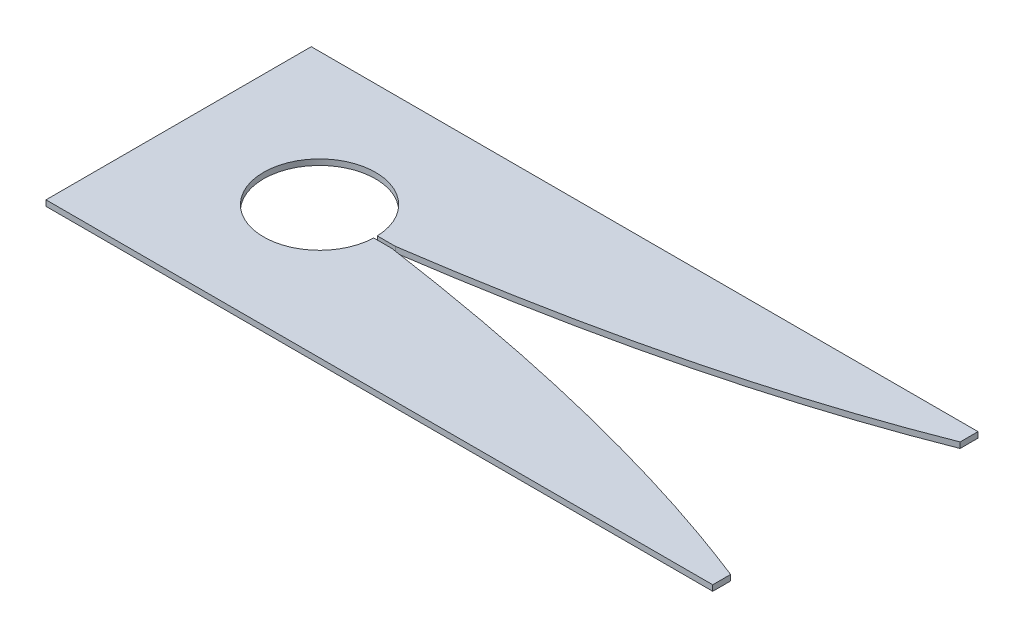
ISO-10303-21;
HEADER;
FILE_DESCRIPTION(('STEP AP214'),'2;1');
FILE_NAME('part.step','',(''),(''),'','','');
FILE_SCHEMA(('AUTOMOTIVE_DESIGN { 1 0 10303 214 1 1 1 1 }'));
ENDSEC;
DATA;
#1=APPLICATION_CONTEXT('core data for automotive mechanical design processes');
#2=APPLICATION_PROTOCOL_DEFINITION('international standard','automotive_design',2000,#1);
#3=PRODUCT_CONTEXT('',#1,'mechanical');
#4=PRODUCT('Part','Part','',(#3));
#5=PRODUCT_RELATED_PRODUCT_CATEGORY('part','',(#4));
#6=PRODUCT_DEFINITION_FORMATION('','',#4);
#7=PRODUCT_DEFINITION_CONTEXT('part definition',#1,'design');
#8=PRODUCT_DEFINITION('design','',#6,#7);
#9=PRODUCT_DEFINITION_SHAPE('','',#8);
#10=(LENGTH_UNIT() NAMED_UNIT(*) SI_UNIT(.MILLI.,.METRE.));
#11=(NAMED_UNIT(*) PLANE_ANGLE_UNIT() SI_UNIT($,.RADIAN.));
#12=(NAMED_UNIT(*) SI_UNIT($,.STERADIAN.) SOLID_ANGLE_UNIT());
#13=UNCERTAINTY_MEASURE_WITH_UNIT(LENGTH_MEASURE(1.E-05),#10,'distance_accuracy_value','');
#14=(GEOMETRIC_REPRESENTATION_CONTEXT(3) GLOBAL_UNCERTAINTY_ASSIGNED_CONTEXT((#13)) GLOBAL_UNIT_ASSIGNED_CONTEXT((#10,
#11,#12)) REPRESENTATION_CONTEXT('',''));
#15=CARTESIAN_POINT('',(0.,0.,0.));
#16=DIRECTION('',(0.,0.,1.));
#17=DIRECTION('',(1.,0.,0.));
#18=AXIS2_PLACEMENT_3D('',#15,#16,#17);
#19=CARTESIAN_POINT('',(92.999941,1.5875,37.000053));
#20=DIRECTION('',(-1.,0.,0.));
#21=DIRECTION('',(0.,0.,1.));
#22=AXIS2_PLACEMENT_3D('',#19,#20,#21);
#23=PLANE('',#22);
#24=DIRECTION('',(0.,0.,-1.));
#25=VECTOR('',#24,1.);
#26=CARTESIAN_POINT('',(92.999941,1.5875,37.000053));
#27=LINE('',#26,#25);
#28=CARTESIAN_POINT('',(92.999941,1.5875,-31.9999356329172));
#29=VERTEX_POINT('',#28);
#30=CARTESIAN_POINT('',(92.999941,1.5875,-37.000053));
#31=VERTEX_POINT('',#30);
#32=EDGE_CURVE('E209',#29,#31,#27,.T.);
#33=ORIENTED_EDGE('',*,*,#32,.F.);
#34=DIRECTION('',(0.,-1.,0.));
#35=VECTOR('',#34,1.);
#36=CARTESIAN_POINT('',(92.999941,1.5875,-31.9999356329173));
#37=LINE('',#36,#35);
#38=CARTESIAN_POINT('',(92.999941,0.,-31.9999356329172));
#39=VERTEX_POINT('',#38);
#40=EDGE_CURVE('E200',#29,#39,#37,.T.);
#41=ORIENTED_EDGE('',*,*,#40,.T.);
#42=DIRECTION('',(0.,0.,-1.));
#43=VECTOR('',#42,1.);
#44=CARTESIAN_POINT('',(92.999941,0.,37.000053));
#45=LINE('',#44,#43);
#46=CARTESIAN_POINT('',(92.999941,0.,-37.000053));
#47=VERTEX_POINT('',#46);
#48=EDGE_CURVE('E220',#39,#47,#45,.T.);
#49=ORIENTED_EDGE('',*,*,#48,.T.);
#50=DIRECTION('',(0.,-1.,0.));
#51=VECTOR('',#50,1.);
#52=CARTESIAN_POINT('',(92.999941,1.5875,-37.000053));
#53=LINE('',#52,#51);
#54=EDGE_CURVE('E229',#31,#47,#53,.T.);
#55=ORIENTED_EDGE('',*,*,#54,.F.);
#56=EDGE_LOOP('',(#33,#41,#49,#55));
#57=FACE_BOUND('',#56,.T.);
#58=ADVANCED_FACE('F50',(#57),#23,.F.);
#59=CARTESIAN_POINT('',(-92.999941,1.5875,37.000053));
#60=DIRECTION('',(-1.,0.,0.));
#61=DIRECTION('',(0.,0.,1.));
#62=AXIS2_PLACEMENT_3D('',#59,#60,#61);
#63=PLANE('',#62);
#64=DIRECTION('',(0.,0.,-1.));
#65=VECTOR('',#64,1.);
#66=CARTESIAN_POINT('',(-92.999941,0.,37.000053));
#67=LINE('',#66,#65);
#68=CARTESIAN_POINT('',(-92.999941,0.,37.000053));
#69=VERTEX_POINT('',#68);
#70=CARTESIAN_POINT('',(-92.999941,0.,-37.000053));
#71=VERTEX_POINT('',#70);
#72=EDGE_CURVE('E203',#69,#71,#67,.T.);
#73=ORIENTED_EDGE('',*,*,#72,.F.);
#74=DIRECTION('',(0.,-1.,0.));
#75=VECTOR('',#74,1.);
#76=CARTESIAN_POINT('',(-92.999941,1.5875,37.000053));
#77=LINE('',#76,#75);
#78=CARTESIAN_POINT('',(-92.999941,1.5875,37.000053));
#79=VERTEX_POINT('',#78);
#80=EDGE_CURVE('E74',#79,#69,#77,.T.);
#81=ORIENTED_EDGE('',*,*,#80,.F.);
#82=DIRECTION('',(0.,0.,-1.));
#83=VECTOR('',#82,1.);
#84=CARTESIAN_POINT('',(-92.999941,1.5875,37.000053));
#85=LINE('',#84,#83);
#86=CARTESIAN_POINT('',(-92.999941,1.5875,-37.000053));
#87=VERTEX_POINT('',#86);
#88=EDGE_CURVE('E204',#79,#87,#85,.T.);
#89=ORIENTED_EDGE('',*,*,#88,.T.);
#90=DIRECTION('',(0.,-1.,0.));
#91=VECTOR('',#90,1.);
#92=CARTESIAN_POINT('',(-92.999941,1.5875,-37.000053));
#93=LINE('',#92,#91);
#94=EDGE_CURVE('E99',#87,#71,#93,.T.);
#95=ORIENTED_EDGE('',*,*,#94,.T.);
#96=EDGE_LOOP('',(#73,#81,#89,#95));
#97=FACE_BOUND('',#96,.T.);
#98=ADVANCED_FACE('F52',(#97),#63,.T.);
#99=CARTESIAN_POINT('',(-92.999941,1.5875,37.000053));
#100=DIRECTION('',(0.,0.,-1.));
#101=DIRECTION('',(-1.,0.,0.));
#102=AXIS2_PLACEMENT_3D('',#99,#100,#101);
#103=PLANE('',#102);
#104=DIRECTION('',(1.,0.,0.));
#105=VECTOR('',#104,1.);
#106=CARTESIAN_POINT('',(-92.999941,0.,37.000053));
#107=LINE('',#106,#105);
#108=CARTESIAN_POINT('',(92.999941,0.,37.000053));
#109=VERTEX_POINT('',#108);
#110=EDGE_CURVE('E207',#69,#109,#107,.T.);
#111=ORIENTED_EDGE('',*,*,#110,.T.);
#112=DIRECTION('',(0.,-1.,0.));
#113=VECTOR('',#112,1.);
#114=CARTESIAN_POINT('',(92.999941,1.5875,37.000053));
#115=LINE('',#114,#113);
#116=CARTESIAN_POINT('',(92.999941,1.5875,37.000053));
#117=VERTEX_POINT('',#116);
#118=EDGE_CURVE('E226',#117,#109,#115,.T.);
#119=ORIENTED_EDGE('',*,*,#118,.F.);
#120=DIRECTION('',(1.,0.,0.));
#121=VECTOR('',#120,1.);
#122=CARTESIAN_POINT('',(-92.999941,1.5875,37.000053));
#123=LINE('',#122,#121);
#124=EDGE_CURVE('E213',#79,#117,#123,.T.);
#125=ORIENTED_EDGE('',*,*,#124,.F.);
#126=ORIENTED_EDGE('',*,*,#80,.T.);
#127=EDGE_LOOP('',(#111,#119,#125,#126));
#128=FACE_BOUND('',#127,.T.);
#129=ADVANCED_FACE('F265',(#128),#103,.F.);
#130=CARTESIAN_POINT('',(92.999941,0.,31.9999356326082));
#131=VERTEX_POINT('',#130);
#132=EDGE_CURVE('E221',#109,#131,#45,.T.);
#133=ORIENTED_EDGE('',*,*,#132,.T.);
#134=DIRECTION('',(0.,1.,0.));
#135=VECTOR('',#134,1.);
#136=CARTESIAN_POINT('',(92.999941,1.5875,31.9999356326082));
#137=LINE('',#136,#135);
#138=CARTESIAN_POINT('',(92.999941,1.5875,31.9999356326082));
#139=VERTEX_POINT('',#138);
#140=EDGE_CURVE('E190',#131,#139,#137,.T.);
#141=ORIENTED_EDGE('',*,*,#140,.T.);
#142=EDGE_CURVE('E210',#117,#139,#27,.T.);
#143=ORIENTED_EDGE('',*,*,#142,.F.);
#144=ORIENTED_EDGE('',*,*,#118,.T.);
#145=EDGE_LOOP('',(#133,#141,#143,#144));
#146=FACE_BOUND('',#145,.T.);
#147=ADVANCED_FACE('F268',(#146),#23,.F.);
#148=CARTESIAN_POINT('',(-92.999941,1.5875,-37.000053));
#149=DIRECTION('',(0.,0.,-1.));
#150=DIRECTION('',(-1.,0.,0.));
#151=AXIS2_PLACEMENT_3D('',#148,#149,#150);
#152=PLANE('',#151);
#153=DIRECTION('',(1.,0.,0.));
#154=VECTOR('',#153,1.);
#155=CARTESIAN_POINT('',(-92.999941,0.,-37.000053));
#156=LINE('',#155,#154);
#157=EDGE_CURVE('E217',#71,#47,#156,.T.);
#158=ORIENTED_EDGE('',*,*,#157,.F.);
#159=ORIENTED_EDGE('',*,*,#94,.F.);
#160=DIRECTION('',(1.,0.,0.));
#161=VECTOR('',#160,1.);
#162=CARTESIAN_POINT('',(-92.999941,1.5875,-37.000053));
#163=LINE('',#162,#161);
#164=EDGE_CURVE('E206',#87,#31,#163,.T.);
#165=ORIENTED_EDGE('',*,*,#164,.T.);
#166=ORIENTED_EDGE('',*,*,#54,.T.);
#167=EDGE_LOOP('',(#158,#159,#165,#166));
#168=FACE_BOUND('',#167,.T.);
#169=ADVANCED_FACE('F260',(#168),#152,.T.);
#170=CARTESIAN_POINT('',(0.,1.5875,0.));
#171=DIRECTION('',(0.,-1.,0.));
#172=DIRECTION('',(0.,0.,-1.));
#173=AXIS2_PLACEMENT_3D('',#170,#171,#172);
#174=PLANE('',#173);
#175=CARTESIAN_POINT('',(92.9639999983848,1.5875,-31.9999356317202));
#176=CARTESIAN_POINT('',(92.7413234028341,1.5875,-31.9121516083799));
#177=CARTESIAN_POINT('',(92.2824844520802,1.5875,-31.7318555070721));
#178=CARTESIAN_POINT('',(91.2914238419887,1.5875,-31.3438006264306));
#179=CARTESIAN_POINT('',(90.3222034107655,1.5875,-30.9687399669261));
#180=CARTESIAN_POINT('',(88.9415512880946,1.5875,-30.4375974416566));
#181=CARTESIAN_POINT('',(87.3598432451995,1.5875,-29.836757063068));
#182=CARTESIAN_POINT('',(85.465097241272,1.5875,-29.1263276716148));
#183=CARTESIAN_POINT('',(83.3244314075179,1.5875,-28.3377815935674));
#184=CARTESIAN_POINT('',(81.4320495838699,1.5875,-27.6519768728103));
#185=CARTESIAN_POINT('',(79.8161903880767,1.5875,-27.0749027747831));
#186=CARTESIAN_POINT('',(78.1933942776226,1.5875,-26.5016943116937));
#187=CARTESIAN_POINT('',(76.0299443100916,1.5875,-25.7462755789429));
#188=CARTESIAN_POINT('',(73.5890954699831,1.5875,-24.9107586062028));
#189=CARTESIAN_POINT('',(70.8719210598207,1.5875,-24.0016871127042));
#190=CARTESIAN_POINT('',(68.1479654932993,1.5875,-23.110854225357));
#191=CARTESIAN_POINT('',(65.9655382039849,1.5875,-22.4092924925014));
#192=CARTESIAN_POINT('',(63.2329669974784,1.5875,-21.5458464178883));
#193=CARTESIAN_POINT('',(59.947265612644,1.5875,-20.5312588090888));
#194=CARTESIAN_POINT('',(56.1044570234878,1.5875,-19.3783785535396));
#195=CARTESIAN_POINT('',(51.7005537982003,1.5875,-18.1021392954443));
#196=CARTESIAN_POINT('',(47.2851165058326,1.5875,-16.8662290967562));
#197=CARTESIAN_POINT('',(42.8589035122644,1.5875,-15.6696882108352));
#198=CARTESIAN_POINT('',(37.9946086231032,1.5875,-14.3998211420612));
#199=CARTESIAN_POINT('',(33.1185517182221,1.5875,-13.1762342868841));
#200=CARTESIAN_POINT('',(28.2313005909117,1.5875,-11.9974336786707));
#201=CARTESIAN_POINT('',(22.2174651876076,1.5875,-10.603163226866));
#202=CARTESIAN_POINT('',(16.6208780347632,1.5875,-9.36547980815923));
#203=CARTESIAN_POINT('',(11.0134666203684,1.5875,-8.18233985098925));
#204=CARTESIAN_POINT('',(4.27022991040086,1.5875,-6.82483511989842));
#205=CARTESIAN_POINT('',(-1.35674668244988,1.5875,-5.74447068063833));
#206=CARTESIAN_POINT('',(-6.43351670914174,1.5875,-4.81495732448502));
#207=CARTESIAN_POINT('',(-10.9454423896842,1.5875,-4.02194290100546));
#208=CARTESIAN_POINT('',(-13.7765103002821,1.5875,-3.53622728640687));
#209=CARTESIAN_POINT('',(-16.022726378814,1.5875,-3.15719422874165));
#210=CARTESIAN_POINT('',(-18.3124057889908,1.5875,-2.77851200286254));
#211=CARTESIAN_POINT('',(-20.5263723426658,1.5875,-2.41749450656961));
#212=CARTESIAN_POINT('',(-22.8723979476973,1.5875,-2.04366009860453));
#213=CARTESIAN_POINT('',(-25.0001316371141,1.5875,-1.70812103921486));
#214=CARTESIAN_POINT('',(-27.4950633291685,1.5875,-1.32517938237059));
#215=CARTESIAN_POINT('',(-29.3709839803506,1.5875,-1.03890684241712));
#216=CARTESIAN_POINT('',(-31.5860357326577,1.5875,-0.710618844173279));
#217=CARTESIAN_POINT('',(-32.5463249910256,1.5875,-0.56924593392239));
#218=CARTESIAN_POINT('',(-33.0200000016517,1.5875,-0.499998887179399));
#219=B_SPLINE_CURVE_WITH_KNOTS('',4,(#175,#176,#177,#178,#179,#180,#181,#182,#183,#184,#185,
#186,#187,#188,#189,#190,#191,#192,#193,#194,#195,#196,#197,#198,#199,#200,#201,#202,#203,#204,
#205,#206,#207,#208,#209,#210,#211,#212,#213,#214,#215,#216,#217,#218),.UNSPECIFIED.,.F.,.F.,(5,
1,1,1,1,1,1,1,1,1,1,1,1,1,1,1,1,1,1,1,1,1,1,1,1,1,1,1,1,1,1,1,1,1,1,1,1,1,1,1,5),
(0.0816312789331893,0.0889875474594602,0.0963438159606334,0.103700084461807,0.11105635296298,
0.125768870568056,0.140481388173131,0.15519390726077,0.169906426348408,0.177262690746391,
0.184618955144375,0.199331483940341,0.228756516656862,0.243469044505909,0.258181572354955,
0.272894098164366,0.287606623973778,0.317031659337775,0.346456716660709,0.375881753364466,
0.405306804206277,0.43473185418677,0.464156891521262,0.504932281131886,0.53435732760056,
0.563782374069234,0.622632465759951,0.652057512476629,0.681482559193308,0.740332650558701,
0.769757697383078,0.784470220795266,0.799182744207455,0.81389526755352,0.828607790899584,
0.843320314245649,0.858032837591714,0.872745360641079,0.887457883690444,0.90217040673981,
0.916882929761849),.UNSPECIFIED.);
#220=CARTESIAN_POINT('',(92.9640000014214,1.5875,-31.9999356329172));
#221=VERTEX_POINT('',#220);
#222=CARTESIAN_POINT('',(-33.0199999984335,1.5875,-0.499998887649878));
#223=VERTEX_POINT('',#222);
#224=EDGE_CURVE('E157',#221,#223,#219,.T.);
#225=ORIENTED_EDGE('',*,*,#224,.F.);
#226=DIRECTION('',(-1.,0.,0.));
#227=VECTOR('',#226,1.);
#228=CARTESIAN_POINT('',(92.9640000014214,1.5875,-31.9999356329172));
#229=LINE('',#228,#227);
#230=EDGE_CURVE('E154',#29,#221,#229,.T.);
#231=ORIENTED_EDGE('',*,*,#230,.F.);
#232=ORIENTED_EDGE('',*,*,#32,.T.);
#233=ORIENTED_EDGE('',*,*,#164,.F.);
#234=ORIENTED_EDGE('',*,*,#88,.F.);
#235=ORIENTED_EDGE('',*,*,#124,.T.);
#236=ORIENTED_EDGE('',*,*,#142,.T.);
#237=DIRECTION('',(1.,0.,0.));
#238=VECTOR('',#237,1.);
#239=CARTESIAN_POINT('',(94.1907730477055,1.5875,31.9999356326082));
#240=LINE('',#239,#238);
#241=CARTESIAN_POINT('',(92.963999999889,1.5875,31.9999356315199));
#242=VERTEX_POINT('',#241);
#243=EDGE_CURVE('E183',#242,#139,#240,.T.);
#244=ORIENTED_EDGE('',*,*,#243,.F.);
#245=CARTESIAN_POINT('',(-33.0200000002696,1.5875,0.499998887466894));
#246=CARTESIAN_POINT('',(-32.5463249896432,1.5875,0.569245934208052));
#247=CARTESIAN_POINT('',(-31.5860357312747,1.5875,0.710618844455222));
#248=CARTESIAN_POINT('',(-29.3709839789664,1.5875,1.03890684269049));
#249=CARTESIAN_POINT('',(-27.4950633277831,1.5875,1.3251793826367));
#250=CARTESIAN_POINT('',(-25.0001316357273,1.5875,1.70812103947131));
#251=CARTESIAN_POINT('',(-22.8723979463092,1.5875,2.04366009885274));
#252=CARTESIAN_POINT('',(-20.5263723412762,1.5875,2.41749450680874));
#253=CARTESIAN_POINT('',(-18.3124057875998,1.5875,2.7785120030931));
#254=CARTESIAN_POINT('',(-16.0227263774216,1.5875,3.15719422896334));
#255=CARTESIAN_POINT('',(-13.7765102988881,1.5875,3.53622728661986));
#256=CARTESIAN_POINT('',(-10.9454423882884,1.5875,4.0219429012075));
#257=CARTESIAN_POINT('',(-6.43351670774287,1.5875,4.81495732466959));
#258=CARTESIAN_POINT('',(-1.35674668104741,1.5875,5.74447068080324));
#259=CARTESIAN_POINT('',(4.27022991180751,1.5875,6.82483512004154));
#260=CARTESIAN_POINT('',(11.0134666217803,1.5875,8.18233985110627));
#261=CARTESIAN_POINT('',(16.6208780361797,1.5875,9.36547980825453));
#262=CARTESIAN_POINT('',(22.2174651890289,1.5875,10.6031632269396));
#263=CARTESIAN_POINT('',(28.2313005923384,1.5875,11.9974336787211));
#264=CARTESIAN_POINT('',(33.1185517196534,1.5875,13.1762342869155));
#265=CARTESIAN_POINT('',(37.9946086245392,1.5875,14.3998211420737));
#266=CARTESIAN_POINT('',(42.8589035137053,1.5875,15.6696882108289));
#267=CARTESIAN_POINT('',(47.2851165072782,1.5875,16.8662290967328));
#268=CARTESIAN_POINT('',(51.7005537996507,1.5875,18.1021392954038));
#269=CARTESIAN_POINT('',(56.1044570249431,1.5875,19.378378553482));
#270=CARTESIAN_POINT('',(59.9472656141037,1.5875,20.5312588090163));
#271=CARTESIAN_POINT('',(63.2329669989421,1.5875,21.5458464178032));
#272=CARTESIAN_POINT('',(65.9655382054519,1.5875,22.4092924924057));
#273=CARTESIAN_POINT('',(68.147965494769,1.5875,23.1108542252529));
#274=CARTESIAN_POINT('',(70.8719210612939,1.5875,24.0016871125895));
#275=CARTESIAN_POINT('',(73.5890954714597,1.5875,24.9107586060776));
#276=CARTESIAN_POINT('',(76.0299443115715,1.5875,25.7462755788082));
#277=CARTESIAN_POINT('',(78.1933942791055,1.5875,26.5016943115506));
#278=CARTESIAN_POINT('',(79.8161903895617,1.5875,27.0749027746337));
#279=CARTESIAN_POINT('',(81.4320495853572,1.5875,27.6519768726547));
#280=CARTESIAN_POINT('',(83.3244314090079,1.5875,28.3377815934045));
#281=CARTESIAN_POINT('',(85.465097242765,1.5875,29.1263276714435));
#282=CARTESIAN_POINT('',(87.3598432466952,1.5875,29.8367570628894));
#283=CARTESIAN_POINT('',(88.9415512895927,1.5875,30.4375974414719));
#284=CARTESIAN_POINT('',(90.3222034122656,1.5875,30.968739966736));
#285=CARTESIAN_POINT('',(91.2914238434903,1.5875,31.3438006262368));
#286=CARTESIAN_POINT('',(92.2824844535833,1.5875,31.7318555068744));
#287=CARTESIAN_POINT('',(92.7413234043379,1.5875,31.9121516081805));
#288=CARTESIAN_POINT('',(92.963999999889,1.5875,31.9999356315199));
#289=B_SPLINE_CURVE_WITH_KNOTS('',4,(#245,#246,#247,#248,#249,#250,#251,#252,#253,#254,#255,
#256,#257,#258,#259,#260,#261,#262,#263,#264,#265,#266,#267,#268,#269,#270,#271,#272,#273,#274,
#275,#276,#277,#278,#279,#280,#281,#282,#283,#284,#285,#286,#287,#288),.UNSPECIFIED.,.F.,.F.,(5,
1,1,1,1,1,1,1,1,1,1,1,1,1,1,1,1,1,1,1,1,1,1,1,1,1,1,1,1,1,1,1,1,1,1,1,1,1,1,1,5),
(0.0816312789309171,0.0963438019552293,0.111056325004594,0.12576884805396,0.140481371103325,
0.15519389444939,0.169906417795454,0.184618941141519,0.199331464487584,0.214043987899772,
0.228756511311961,0.258181558136338,0.317031649501731,0.346456696218409,0.375881742935087,
0.434731834625805,0.464156881094478,0.493581927563152,0.534357317173776,0.563782354508268,
0.593207404488761,0.622632455330572,0.65205749203433,0.681482549357263,0.710907584721261,
0.725620110530672,0.740332636340084,0.75504516418913,0.769757692038177,0.799182724754697,
0.813895253550664,0.821251517948647,0.828607782346631,0.843320301434269,0.858032820521907,
0.872745338126983,0.887457855732059,0.894814124233232,0.902170392734405,0.909526661235579,
0.916882929759568),.UNSPECIFIED.);
#290=CARTESIAN_POINT('',(-33.0199999973439,1.5875,0.499998887894597));
#291=VERTEX_POINT('',#290);
#292=EDGE_CURVE('E178',#291,#242,#289,.T.);
#293=ORIENTED_EDGE('',*,*,#292,.F.);
#294=DIRECTION('',(1.,0.,0.));
#295=VECTOR('',#294,1.);
#296=CARTESIAN_POINT('',(-38.0763464790078,1.5875,0.499998887894597));
#297=LINE('',#296,#295);
#298=CARTESIAN_POINT('',(-38.0763464790078,1.5875,0.499998887894597));
#299=VERTEX_POINT('',#298);
#300=EDGE_CURVE('E170',#299,#291,#297,.T.);
#301=ORIENTED_EDGE('',*,*,#300,.F.);
#302=CARTESIAN_POINT('',(-53.6893424168291,1.5875,4.23199016448941E-08));
#303=DIRECTION('',(0.,1.,0.));
#304=DIRECTION('',(0.,0.,1.));
#305=AXIS2_PLACEMENT_3D('',#302,#303,#304);
#306=CIRCLE('',#305,15.621);
#307=CARTESIAN_POINT('',(-38.0763464817105,1.5875,-0.499998887649877));
#308=VERTEX_POINT('',#307);
#309=EDGE_CURVE('E168',#308,#299,#306,.T.);
#310=ORIENTED_EDGE('',*,*,#309,.F.);
#311=DIRECTION('',(-1.,0.,0.));
#312=VECTOR('',#311,1.);
#313=CARTESIAN_POINT('',(-33.0199999984335,1.5875,-0.499998887649878));
#314=LINE('',#313,#312);
#315=EDGE_CURVE('E148',#223,#308,#314,.T.);
#316=ORIENTED_EDGE('',*,*,#315,.F.);
#317=EDGE_LOOP('',(#225,#231,#232,#233,#234,#235,#236,#244,#293,#301,#310,#316));
#318=FACE_BOUND('',#317,.T.);
#319=ADVANCED_FACE('F165',(#318),#174,.F.);
#320=CARTESIAN_POINT('',(0.,0.,0.));
#321=DIRECTION('',(0.,-1.,0.));
#322=DIRECTION('',(0.,0.,-1.));
#323=AXIS2_PLACEMENT_3D('',#320,#321,#322);
#324=PLANE('',#323);
#325=DIRECTION('',(1.,0.,0.));
#326=VECTOR('',#325,1.);
#327=CARTESIAN_POINT('',(0.,0.,-31.9999356329172));
#328=LINE('',#327,#326);
#329=CARTESIAN_POINT('',(92.9640000014214,0.,-31.9999356329172));
#330=VERTEX_POINT('',#329);
#331=EDGE_CURVE('E13',#330,#39,#328,.T.);
#332=ORIENTED_EDGE('',*,*,#331,.F.);
#333=CARTESIAN_POINT('',(92.9639999983848,0.,-31.9999356317202));
#334=CARTESIAN_POINT('',(92.7413234028341,0.,-31.9121516083799));
#335=CARTESIAN_POINT('',(92.2824844520802,0.,-31.7318555070721));
#336=CARTESIAN_POINT('',(91.2914238419887,0.,-31.3438006264306));
#337=CARTESIAN_POINT('',(90.3222034107655,0.,-30.9687399669261));
#338=CARTESIAN_POINT('',(88.9415512880946,0.,-30.4375974416566));
#339=CARTESIAN_POINT('',(87.3598432451995,0.,-29.836757063068));
#340=CARTESIAN_POINT('',(85.465097241272,0.,-29.1263276716148));
#341=CARTESIAN_POINT('',(83.3244314075179,0.,-28.3377815935674));
#342=CARTESIAN_POINT('',(81.4320495838699,0.,-27.6519768728103));
#343=CARTESIAN_POINT('',(79.8161903880767,0.,-27.0749027747831));
#344=CARTESIAN_POINT('',(78.1933942776226,0.,-26.5016943116937));
#345=CARTESIAN_POINT('',(76.0299443100916,0.,-25.7462755789429));
#346=CARTESIAN_POINT('',(73.5890954699831,0.,-24.9107586062028));
#347=CARTESIAN_POINT('',(70.8719210598207,0.,-24.0016871127042));
#348=CARTESIAN_POINT('',(68.1479654932993,0.,-23.110854225357));
#349=CARTESIAN_POINT('',(65.9655382039849,0.,-22.4092924925014));
#350=CARTESIAN_POINT('',(63.2329669974784,0.,-21.5458464178883));
#351=CARTESIAN_POINT('',(59.947265612644,0.,-20.5312588090888));
#352=CARTESIAN_POINT('',(56.1044570234878,0.,-19.3783785535396));
#353=CARTESIAN_POINT('',(51.7005537982003,0.,-18.1021392954443));
#354=CARTESIAN_POINT('',(47.2851165058326,0.,-16.8662290967562));
#355=CARTESIAN_POINT('',(42.8589035122644,0.,-15.6696882108352));
#356=CARTESIAN_POINT('',(37.9946086231032,0.,-14.3998211420612));
#357=CARTESIAN_POINT('',(33.1185517182221,0.,-13.1762342868841));
#358=CARTESIAN_POINT('',(28.2313005909117,0.,-11.9974336786707));
#359=CARTESIAN_POINT('',(22.2174651876076,0.,-10.603163226866));
#360=CARTESIAN_POINT('',(16.6208780347632,0.,-9.36547980815923));
#361=CARTESIAN_POINT('',(11.0134666203684,0.,-8.18233985098925));
#362=CARTESIAN_POINT('',(4.27022991040086,0.,-6.82483511989842));
#363=CARTESIAN_POINT('',(-1.35674668244988,0.,-5.74447068063833));
#364=CARTESIAN_POINT('',(-6.43351670914174,0.,-4.81495732448502));
#365=CARTESIAN_POINT('',(-10.9454423896842,0.,-4.02194290100546));
#366=CARTESIAN_POINT('',(-13.7765103002821,0.,-3.53622728640687));
#367=CARTESIAN_POINT('',(-16.022726378814,0.,-3.15719422874165));
#368=CARTESIAN_POINT('',(-18.3124057889908,0.,-2.77851200286254));
#369=CARTESIAN_POINT('',(-20.5263723426658,0.,-2.41749450656961));
#370=CARTESIAN_POINT('',(-22.8723979476973,0.,-2.04366009860453));
#371=CARTESIAN_POINT('',(-25.0001316371141,0.,-1.70812103921486));
#372=CARTESIAN_POINT('',(-27.4950633291685,0.,-1.32517938237059));
#373=CARTESIAN_POINT('',(-29.3709839803506,0.,-1.03890684241712));
#374=CARTESIAN_POINT('',(-31.5860357326577,0.,-0.710618844173279));
#375=CARTESIAN_POINT('',(-32.5463249910256,0.,-0.56924593392239));
#376=CARTESIAN_POINT('',(-33.0200000016517,0.,-0.499998887179399));
#377=B_SPLINE_CURVE_WITH_KNOTS('',4,(#333,#334,#335,#336,#337,#338,#339,#340,#341,#342,#343,
#344,#345,#346,#347,#348,#349,#350,#351,#352,#353,#354,#355,#356,#357,#358,#359,#360,#361,#362,
#363,#364,#365,#366,#367,#368,#369,#370,#371,#372,#373,#374,#375,#376),.UNSPECIFIED.,.F.,.F.,(5,
1,1,1,1,1,1,1,1,1,1,1,1,1,1,1,1,1,1,1,1,1,1,1,1,1,1,1,1,1,1,1,1,1,1,1,1,1,1,1,5),
(0.0816312789331893,0.0889875474594602,0.0963438159606334,0.103700084461807,0.11105635296298,
0.125768870568056,0.140481388173131,0.15519390726077,0.169906426348408,0.177262690746391,
0.184618955144375,0.199331483940341,0.228756516656862,0.243469044505909,0.258181572354955,
0.272894098164366,0.287606623973778,0.317031659337775,0.346456716660709,0.375881753364466,
0.405306804206277,0.43473185418677,0.464156891521262,0.504932281131886,0.53435732760056,
0.563782374069234,0.622632465759951,0.652057512476629,0.681482559193308,0.740332650558701,
0.769757697383078,0.784470220795266,0.799182744207455,0.81389526755352,0.828607790899584,
0.843320314245649,0.858032837591714,0.872745360641079,0.887457883690444,0.90217040673981,
0.916882929761849),.UNSPECIFIED.);
#378=CARTESIAN_POINT('',(-33.0199999984335,0.,-0.499998887649878));
#379=VERTEX_POINT('',#378);
#380=EDGE_CURVE('E58',#379,#330,#377,.F.);
#381=ORIENTED_EDGE('',*,*,#380,.F.);
#382=DIRECTION('',(1.,0.,0.));
#383=VECTOR('',#382,1.);
#384=CARTESIAN_POINT('',(0.,0.,-0.499998887649881));
#385=LINE('',#384,#383);
#386=CARTESIAN_POINT('',(-38.0763464817105,0.,-0.499998887649877));
#387=VERTEX_POINT('',#386);
#388=EDGE_CURVE('E151',#387,#379,#385,.T.);
#389=ORIENTED_EDGE('',*,*,#388,.F.);
#390=CARTESIAN_POINT('',(-53.6893424168291,0.,4.23199016448941E-08));
#391=DIRECTION('',(0.,-1.,0.));
#392=DIRECTION('',(0.,0.,-1.));
#393=AXIS2_PLACEMENT_3D('',#390,#391,#392);
#394=CIRCLE('',#393,15.621);
#395=CARTESIAN_POINT('',(-38.0763464790078,0.,0.499998887894597));
#396=VERTEX_POINT('',#395);
#397=EDGE_CURVE('E234',#396,#387,#394,.T.);
#398=ORIENTED_EDGE('',*,*,#397,.F.);
#399=DIRECTION('',(-1.,0.,0.));
#400=VECTOR('',#399,1.);
#401=CARTESIAN_POINT('',(0.,0.,0.499998887894597));
#402=LINE('',#401,#400);
#403=CARTESIAN_POINT('',(-33.0199999973439,0.,0.499998887894597));
#404=VERTEX_POINT('',#403);
#405=EDGE_CURVE('E236',#404,#396,#402,.T.);
#406=ORIENTED_EDGE('',*,*,#405,.F.);
#407=CARTESIAN_POINT('',(-33.0200000002696,0.,0.499998887466894));
#408=CARTESIAN_POINT('',(-32.5463249896432,0.,0.569245934208052));
#409=CARTESIAN_POINT('',(-31.5860357312747,0.,0.710618844455222));
#410=CARTESIAN_POINT('',(-29.3709839789664,0.,1.03890684269049));
#411=CARTESIAN_POINT('',(-27.4950633277831,0.,1.3251793826367));
#412=CARTESIAN_POINT('',(-25.0001316357273,0.,1.70812103947131));
#413=CARTESIAN_POINT('',(-22.8723979463092,0.,2.04366009885274));
#414=CARTESIAN_POINT('',(-20.5263723412762,0.,2.41749450680874));
#415=CARTESIAN_POINT('',(-18.3124057875998,0.,2.7785120030931));
#416=CARTESIAN_POINT('',(-16.0227263774216,0.,3.15719422896334));
#417=CARTESIAN_POINT('',(-13.7765102988881,0.,3.53622728661986));
#418=CARTESIAN_POINT('',(-10.9454423882884,0.,4.0219429012075));
#419=CARTESIAN_POINT('',(-6.43351670774287,0.,4.81495732466959));
#420=CARTESIAN_POINT('',(-1.35674668104741,0.,5.74447068080324));
#421=CARTESIAN_POINT('',(4.27022991180751,0.,6.82483512004154));
#422=CARTESIAN_POINT('',(11.0134666217803,0.,8.18233985110627));
#423=CARTESIAN_POINT('',(16.6208780361797,0.,9.36547980825453));
#424=CARTESIAN_POINT('',(22.2174651890289,0.,10.6031632269396));
#425=CARTESIAN_POINT('',(28.2313005923384,0.,11.9974336787211));
#426=CARTESIAN_POINT('',(33.1185517196534,0.,13.1762342869155));
#427=CARTESIAN_POINT('',(37.9946086245392,0.,14.3998211420737));
#428=CARTESIAN_POINT('',(42.8589035137053,0.,15.6696882108289));
#429=CARTESIAN_POINT('',(47.2851165072782,0.,16.8662290967328));
#430=CARTESIAN_POINT('',(51.7005537996507,0.,18.1021392954038));
#431=CARTESIAN_POINT('',(56.1044570249431,0.,19.378378553482));
#432=CARTESIAN_POINT('',(59.9472656141037,0.,20.5312588090163));
#433=CARTESIAN_POINT('',(63.2329669989421,0.,21.5458464178032));
#434=CARTESIAN_POINT('',(65.9655382054519,0.,22.4092924924057));
#435=CARTESIAN_POINT('',(68.147965494769,0.,23.1108542252529));
#436=CARTESIAN_POINT('',(70.8719210612939,0.,24.0016871125895));
#437=CARTESIAN_POINT('',(73.5890954714597,0.,24.9107586060776));
#438=CARTESIAN_POINT('',(76.0299443115715,0.,25.7462755788082));
#439=CARTESIAN_POINT('',(78.1933942791055,0.,26.5016943115506));
#440=CARTESIAN_POINT('',(79.8161903895617,0.,27.0749027746337));
#441=CARTESIAN_POINT('',(81.4320495853572,0.,27.6519768726547));
#442=CARTESIAN_POINT('',(83.3244314090079,0.,28.3377815934045));
#443=CARTESIAN_POINT('',(85.465097242765,0.,29.1263276714435));
#444=CARTESIAN_POINT('',(87.3598432466952,0.,29.8367570628894));
#445=CARTESIAN_POINT('',(88.9415512895927,0.,30.4375974414719));
#446=CARTESIAN_POINT('',(90.3222034122656,0.,30.968739966736));
#447=CARTESIAN_POINT('',(91.2914238434903,0.,31.3438006262368));
#448=CARTESIAN_POINT('',(92.2824844535833,0.,31.7318555068744));
#449=CARTESIAN_POINT('',(92.7413234043379,0.,31.9121516081805));
#450=CARTESIAN_POINT('',(92.963999999889,0.,31.9999356315199));
#451=B_SPLINE_CURVE_WITH_KNOTS('',4,(#407,#408,#409,#410,#411,#412,#413,#414,#415,#416,#417,
#418,#419,#420,#421,#422,#423,#424,#425,#426,#427,#428,#429,#430,#431,#432,#433,#434,#435,#436,
#437,#438,#439,#440,#441,#442,#443,#444,#445,#446,#447,#448,#449,#450),.UNSPECIFIED.,.F.,.F.,(5,
1,1,1,1,1,1,1,1,1,1,1,1,1,1,1,1,1,1,1,1,1,1,1,1,1,1,1,1,1,1,1,1,1,1,1,1,1,1,1,5),
(0.0816312789309171,0.0963438019552293,0.111056325004594,0.12576884805396,0.140481371103325,
0.15519389444939,0.169906417795454,0.184618941141519,0.199331464487584,0.214043987899772,
0.228756511311961,0.258181558136338,0.317031649501731,0.346456696218409,0.375881742935087,
0.434731834625805,0.464156881094478,0.493581927563152,0.534357317173776,0.563782354508268,
0.593207404488761,0.622632455330572,0.65205749203433,0.681482549357263,0.710907584721261,
0.725620110530672,0.740332636340084,0.75504516418913,0.769757692038177,0.799182724754697,
0.813895253550664,0.821251517948647,0.828607782346631,0.843320301434269,0.858032820521907,
0.872745338126983,0.887457855732059,0.894814124233232,0.902170392734405,0.909526661235579,
0.916882929759568),.UNSPECIFIED.);
#452=CARTESIAN_POINT('',(92.963999999889,0.,31.9999356315199));
#453=VERTEX_POINT('',#452);
#454=EDGE_CURVE('E238',#453,#404,#451,.F.);
#455=ORIENTED_EDGE('',*,*,#454,.F.);
#456=DIRECTION('',(-1.,0.,0.));
#457=VECTOR('',#456,1.);
#458=CARTESIAN_POINT('',(0.,0.,31.9999356326082));
#459=LINE('',#458,#457);
#460=EDGE_CURVE('E242',#131,#453,#459,.T.);
#461=ORIENTED_EDGE('',*,*,#460,.F.);
#462=ORIENTED_EDGE('',*,*,#132,.F.);
#463=ORIENTED_EDGE('',*,*,#110,.F.);
#464=ORIENTED_EDGE('',*,*,#72,.T.);
#465=ORIENTED_EDGE('',*,*,#157,.T.);
#466=ORIENTED_EDGE('',*,*,#48,.F.);
#467=EDGE_LOOP('',(#332,#381,#389,#398,#406,#455,#461,#462,#463,#464,#465,#466));
#468=FACE_BOUND('',#467,.T.);
#469=ADVANCED_FACE('F256',(#468),#324,.T.);
#470=CARTESIAN_POINT('',(92.9640000014214,-0.9525,-31.9999356329172));
#471=DIRECTION('',(0.,0.,-1.));
#472=DIRECTION('',(-1.,0.,0.));
#473=AXIS2_PLACEMENT_3D('',#470,#471,#472);
#474=PLANE('',#473);
#475=ORIENTED_EDGE('',*,*,#230,.T.);
#476=DIRECTION('',(0.,1.,0.));
#477=VECTOR('',#476,1.);
#478=CARTESIAN_POINT('',(92.9640000014214,-0.9525,-31.9999356329172));
#479=LINE('',#478,#477);
#480=EDGE_CURVE('E160',#330,#221,#479,.T.);
#481=ORIENTED_EDGE('',*,*,#480,.F.);
#482=ORIENTED_EDGE('',*,*,#331,.T.);
#483=ORIENTED_EDGE('',*,*,#40,.F.);
#484=EDGE_LOOP('',(#475,#481,#482,#483));
#485=FACE_BOUND('',#484,.T.);
#486=ADVANCED_FACE('F254',(#485),#474,.F.);
#487=CARTESIAN_POINT('',(94.1907730477055,-0.9525,31.9999356326082));
#488=DIRECTION('',(0.,0.,1.));
#489=DIRECTION('',(1.,0.,0.));
#490=AXIS2_PLACEMENT_3D('',#487,#488,#489);
#491=PLANE('',#490);
#492=ORIENTED_EDGE('',*,*,#460,.T.);
#493=DIRECTION('',(0.,1.,0.));
#494=VECTOR('',#493,1.);
#495=CARTESIAN_POINT('',(92.963999999889,-0.9525,31.9999356315199));
#496=LINE('',#495,#494);
#497=EDGE_CURVE('E191',#453,#242,#496,.T.);
#498=ORIENTED_EDGE('',*,*,#497,.T.);
#499=ORIENTED_EDGE('',*,*,#243,.T.);
#500=ORIENTED_EDGE('',*,*,#140,.F.);
#501=EDGE_LOOP('',(#492,#498,#499,#500));
#502=FACE_BOUND('',#501,.T.);
#503=ADVANCED_FACE('F272',(#502),#491,.F.);
#504=CARTESIAN_POINT('',(92.9639999983848,-0.9525,-31.9999356317202));
#505=CARTESIAN_POINT('',(92.7413234028341,-0.9525,-31.9121516083799));
#506=CARTESIAN_POINT('',(92.2824844520802,-0.9525,-31.7318555070721));
#507=CARTESIAN_POINT('',(91.2914238419887,-0.9525,-31.3438006264306));
#508=CARTESIAN_POINT('',(90.3222034107655,-0.9525,-30.9687399669261));
#509=CARTESIAN_POINT('',(88.9415512880946,-0.9525,-30.4375974416566));
#510=CARTESIAN_POINT('',(87.3598432451995,-0.9525,-29.836757063068));
#511=CARTESIAN_POINT('',(85.465097241272,-0.9525,-29.1263276716148));
#512=CARTESIAN_POINT('',(83.3244314075179,-0.9525,-28.3377815935674));
#513=CARTESIAN_POINT('',(81.4320495838699,-0.9525,-27.6519768728103));
#514=CARTESIAN_POINT('',(79.8161903880767,-0.9525,-27.0749027747831));
#515=CARTESIAN_POINT('',(78.1933942776226,-0.9525,-26.5016943116937));
#516=CARTESIAN_POINT('',(76.0299443100916,-0.9525,-25.7462755789429));
#517=CARTESIAN_POINT('',(73.5890954699831,-0.9525,-24.9107586062028));
#518=CARTESIAN_POINT('',(70.8719210598207,-0.9525,-24.0016871127042));
#519=CARTESIAN_POINT('',(68.1479654932993,-0.9525,-23.110854225357));
#520=CARTESIAN_POINT('',(65.9655382039849,-0.9525,-22.4092924925014));
#521=CARTESIAN_POINT('',(63.2329669974784,-0.9525,-21.5458464178883));
#522=CARTESIAN_POINT('',(59.947265612644,-0.9525,-20.5312588090888));
#523=CARTESIAN_POINT('',(56.1044570234878,-0.9525,-19.3783785535396));
#524=CARTESIAN_POINT('',(51.7005537982003,-0.9525,-18.1021392954443));
#525=CARTESIAN_POINT('',(47.2851165058326,-0.9525,-16.8662290967562));
#526=CARTESIAN_POINT('',(42.8589035122644,-0.9525,-15.6696882108352));
#527=CARTESIAN_POINT('',(37.9946086231032,-0.9525,-14.3998211420612));
#528=CARTESIAN_POINT('',(33.1185517182221,-0.9525,-13.1762342868841));
#529=CARTESIAN_POINT('',(28.2313005909117,-0.9525,-11.9974336786707));
#530=CARTESIAN_POINT('',(22.2174651876076,-0.9525,-10.603163226866));
#531=CARTESIAN_POINT('',(16.6208780347632,-0.9525,-9.36547980815923));
#532=CARTESIAN_POINT('',(11.0134666203684,-0.9525,-8.18233985098925));
#533=CARTESIAN_POINT('',(4.27022991040086,-0.9525,-6.82483511989842));
#534=CARTESIAN_POINT('',(-1.35674668244988,-0.9525,-5.74447068063833));
#535=CARTESIAN_POINT('',(-6.43351670914174,-0.9525,-4.81495732448502));
#536=CARTESIAN_POINT('',(-10.9454423896842,-0.9525,-4.02194290100546));
#537=CARTESIAN_POINT('',(-13.7765103002821,-0.9525,-3.53622728640687));
#538=CARTESIAN_POINT('',(-16.022726378814,-0.9525,-3.15719422874165));
#539=CARTESIAN_POINT('',(-18.3124057889908,-0.9525,-2.77851200286254));
#540=CARTESIAN_POINT('',(-20.5263723426658,-0.9525,-2.41749450656961));
#541=CARTESIAN_POINT('',(-22.8723979476973,-0.9525,-2.04366009860453));
#542=CARTESIAN_POINT('',(-25.0001316371141,-0.9525,-1.70812103921486));
#543=CARTESIAN_POINT('',(-27.4950633291685,-0.9525,-1.32517938237059));
#544=CARTESIAN_POINT('',(-29.3709839803506,-0.9525,-1.03890684241712));
#545=CARTESIAN_POINT('',(-31.5860357326577,-0.9525,-0.710618844173279));
#546=CARTESIAN_POINT('',(-32.5463249910256,-0.9525,-0.56924593392239));
#547=CARTESIAN_POINT('',(-33.0200000016517,-0.9525,-0.499998887179399));
#548=B_SPLINE_CURVE_WITH_KNOTS('',4,(#504,#505,#506,#507,#508,#509,#510,#511,#512,#513,#514,
#515,#516,#517,#518,#519,#520,#521,#522,#523,#524,#525,#526,#527,#528,#529,#530,#531,#532,#533,
#534,#535,#536,#537,#538,#539,#540,#541,#542,#543,#544,#545,#546,#547),.UNSPECIFIED.,.F.,.F.,(5,
1,1,1,1,1,1,1,1,1,1,1,1,1,1,1,1,1,1,1,1,1,1,1,1,1,1,1,1,1,1,1,1,1,1,1,1,1,1,1,5),
(0.0816312789331893,0.0889875474594602,0.0963438159606334,0.103700084461807,0.11105635296298,
0.125768870568056,0.140481388173131,0.15519390726077,0.169906426348408,0.177262690746391,
0.184618955144375,0.199331483940341,0.228756516656862,0.243469044505909,0.258181572354955,
0.272894098164366,0.287606623973778,0.317031659337775,0.346456716660709,0.375881753364466,
0.405306804206277,0.43473185418677,0.464156891521262,0.504932281131886,0.53435732760056,
0.563782374069234,0.622632465759951,0.652057512476629,0.681482559193308,0.740332650558701,
0.769757697383078,0.784470220795266,0.799182744207455,0.81389526755352,0.828607790899584,
0.843320314245649,0.858032837591714,0.872745360641079,0.887457883690444,0.90217040673981,
0.916882929761849),.UNSPECIFIED.);
#549=DIRECTION('',(0.,1.,0.));
#550=VECTOR('',#549,1.);
#551=SURFACE_OF_LINEAR_EXTRUSION('',#548,#550);
#552=ORIENTED_EDGE('',*,*,#380,.T.);
#553=ORIENTED_EDGE('',*,*,#480,.T.);
#554=ORIENTED_EDGE('',*,*,#224,.T.);
#555=DIRECTION('',(0.,1.,0.));
#556=VECTOR('',#555,1.);
#557=CARTESIAN_POINT('',(-33.0199999984335,-0.9525,-0.499998887649878));
#558=LINE('',#557,#556);
#559=EDGE_CURVE('E144',#379,#223,#558,.T.);
#560=ORIENTED_EDGE('',*,*,#559,.F.);
#561=EDGE_LOOP('',(#552,#553,#554,#560));
#562=FACE_BOUND('',#561,.T.);
#563=ADVANCED_FACE('F158',(#562),#551,.F.);
#564=CARTESIAN_POINT('',(-33.0200000002696,-0.9525,0.499998887466894));
#565=CARTESIAN_POINT('',(-32.5463249896432,-0.9525,0.569245934208052));
#566=CARTESIAN_POINT('',(-31.5860357312747,-0.9525,0.710618844455222));
#567=CARTESIAN_POINT('',(-29.3709839789664,-0.9525,1.03890684269049));
#568=CARTESIAN_POINT('',(-27.4950633277831,-0.9525,1.3251793826367));
#569=CARTESIAN_POINT('',(-25.0001316357273,-0.9525,1.70812103947131));
#570=CARTESIAN_POINT('',(-22.8723979463092,-0.9525,2.04366009885274));
#571=CARTESIAN_POINT('',(-20.5263723412762,-0.9525,2.41749450680874));
#572=CARTESIAN_POINT('',(-18.3124057875998,-0.9525,2.7785120030931));
#573=CARTESIAN_POINT('',(-16.0227263774216,-0.9525,3.15719422896334));
#574=CARTESIAN_POINT('',(-13.7765102988881,-0.9525,3.53622728661986));
#575=CARTESIAN_POINT('',(-10.9454423882884,-0.9525,4.0219429012075));
#576=CARTESIAN_POINT('',(-6.43351670774287,-0.9525,4.81495732466959));
#577=CARTESIAN_POINT('',(-1.35674668104741,-0.9525,5.74447068080324));
#578=CARTESIAN_POINT('',(4.27022991180751,-0.9525,6.82483512004154));
#579=CARTESIAN_POINT('',(11.0134666217803,-0.9525,8.18233985110627));
#580=CARTESIAN_POINT('',(16.6208780361797,-0.9525,9.36547980825453));
#581=CARTESIAN_POINT('',(22.2174651890289,-0.9525,10.6031632269396));
#582=CARTESIAN_POINT('',(28.2313005923384,-0.9525,11.9974336787211));
#583=CARTESIAN_POINT('',(33.1185517196534,-0.9525,13.1762342869155));
#584=CARTESIAN_POINT('',(37.9946086245392,-0.9525,14.3998211420737));
#585=CARTESIAN_POINT('',(42.8589035137053,-0.9525,15.6696882108289));
#586=CARTESIAN_POINT('',(47.2851165072782,-0.9525,16.8662290967328));
#587=CARTESIAN_POINT('',(51.7005537996507,-0.9525,18.1021392954038));
#588=CARTESIAN_POINT('',(56.1044570249431,-0.9525,19.378378553482));
#589=CARTESIAN_POINT('',(59.9472656141037,-0.9525,20.5312588090163));
#590=CARTESIAN_POINT('',(63.2329669989421,-0.9525,21.5458464178032));
#591=CARTESIAN_POINT('',(65.9655382054519,-0.9525,22.4092924924057));
#592=CARTESIAN_POINT('',(68.147965494769,-0.9525,23.1108542252529));
#593=CARTESIAN_POINT('',(70.8719210612939,-0.9525,24.0016871125895));
#594=CARTESIAN_POINT('',(73.5890954714597,-0.9525,24.9107586060776));
#595=CARTESIAN_POINT('',(76.0299443115715,-0.9525,25.7462755788082));
#596=CARTESIAN_POINT('',(78.1933942791055,-0.9525,26.5016943115506));
#597=CARTESIAN_POINT('',(79.8161903895617,-0.9525,27.0749027746337));
#598=CARTESIAN_POINT('',(81.4320495853572,-0.9525,27.6519768726547));
#599=CARTESIAN_POINT('',(83.3244314090079,-0.9525,28.3377815934045));
#600=CARTESIAN_POINT('',(85.465097242765,-0.9525,29.1263276714435));
#601=CARTESIAN_POINT('',(87.3598432466952,-0.9525,29.8367570628894));
#602=CARTESIAN_POINT('',(88.9415512895927,-0.9525,30.4375974414719));
#603=CARTESIAN_POINT('',(90.3222034122656,-0.9525,30.968739966736));
#604=CARTESIAN_POINT('',(91.2914238434903,-0.9525,31.3438006262368));
#605=CARTESIAN_POINT('',(92.2824844535833,-0.9525,31.7318555068744));
#606=CARTESIAN_POINT('',(92.7413234043379,-0.9525,31.9121516081805));
#607=CARTESIAN_POINT('',(92.963999999889,-0.9525,31.9999356315199));
#608=B_SPLINE_CURVE_WITH_KNOTS('',4,(#564,#565,#566,#567,#568,#569,#570,#571,#572,#573,#574,
#575,#576,#577,#578,#579,#580,#581,#582,#583,#584,#585,#586,#587,#588,#589,#590,#591,#592,#593,
#594,#595,#596,#597,#598,#599,#600,#601,#602,#603,#604,#605,#606,#607),.UNSPECIFIED.,.F.,.F.,(5,
1,1,1,1,1,1,1,1,1,1,1,1,1,1,1,1,1,1,1,1,1,1,1,1,1,1,1,1,1,1,1,1,1,1,1,1,1,1,1,5),
(0.0816312789309171,0.0963438019552293,0.111056325004594,0.12576884805396,0.140481371103325,
0.15519389444939,0.169906417795454,0.184618941141519,0.199331464487584,0.214043987899772,
0.228756511311961,0.258181558136338,0.317031649501731,0.346456696218409,0.375881742935087,
0.434731834625805,0.464156881094478,0.493581927563152,0.534357317173776,0.563782354508268,
0.593207404488761,0.622632455330572,0.65205749203433,0.681482549357263,0.710907584721261,
0.725620110530672,0.740332636340084,0.75504516418913,0.769757692038177,0.799182724754697,
0.813895253550664,0.821251517948647,0.828607782346631,0.843320301434269,0.858032820521907,
0.872745338126983,0.887457855732059,0.894814124233232,0.902170392734405,0.909526661235579,
0.916882929759568),.UNSPECIFIED.);
#609=DIRECTION('',(0.,1.,0.));
#610=VECTOR('',#609,1.);
#611=SURFACE_OF_LINEAR_EXTRUSION('',#608,#610);
#612=ORIENTED_EDGE('',*,*,#454,.T.);
#613=DIRECTION('',(0.,1.,0.));
#614=VECTOR('',#613,1.);
#615=CARTESIAN_POINT('',(-33.0199999973439,-0.9525,0.499998887894597));
#616=LINE('',#615,#614);
#617=EDGE_CURVE('E193',#404,#291,#616,.T.);
#618=ORIENTED_EDGE('',*,*,#617,.T.);
#619=ORIENTED_EDGE('',*,*,#292,.T.);
#620=ORIENTED_EDGE('',*,*,#497,.F.);
#621=EDGE_LOOP('',(#612,#618,#619,#620));
#622=FACE_BOUND('',#621,.T.);
#623=ADVANCED_FACE('F276',(#622),#611,.F.);
#624=CARTESIAN_POINT('',(-38.0763464790078,-0.9525,0.499998887894597));
#625=DIRECTION('',(0.,0.,1.));
#626=DIRECTION('',(1.,0.,0.));
#627=AXIS2_PLACEMENT_3D('',#624,#625,#626);
#628=PLANE('',#627);
#629=ORIENTED_EDGE('',*,*,#405,.T.);
#630=DIRECTION('',(0.,1.,0.));
#631=VECTOR('',#630,1.);
#632=CARTESIAN_POINT('',(-38.0763464790078,-0.9525,0.499998887894597));
#633=LINE('',#632,#631);
#634=EDGE_CURVE('E195',#396,#299,#633,.T.);
#635=ORIENTED_EDGE('',*,*,#634,.T.);
#636=ORIENTED_EDGE('',*,*,#300,.T.);
#637=ORIENTED_EDGE('',*,*,#617,.F.);
#638=EDGE_LOOP('',(#629,#635,#636,#637));
#639=FACE_BOUND('',#638,.T.);
#640=ADVANCED_FACE('F280',(#639),#628,.F.);
#641=CARTESIAN_POINT('',(-53.6893424168291,-0.9525,4.23199016448941E-08));
#642=DIRECTION('',(0.,1.,0.));
#643=DIRECTION('',(0.,0.,1.));
#644=AXIS2_PLACEMENT_3D('',#641,#642,#643);
#645=CYLINDRICAL_SURFACE('',#644,15.621);
#646=ORIENTED_EDGE('',*,*,#397,.T.);
#647=DIRECTION('',(0.,1.,0.));
#648=VECTOR('',#647,1.);
#649=CARTESIAN_POINT('',(-38.0763464817105,-0.9525,-0.499998887649877));
#650=LINE('',#649,#648);
#651=EDGE_CURVE('E65',#387,#308,#650,.T.);
#652=ORIENTED_EDGE('',*,*,#651,.T.);
#653=ORIENTED_EDGE('',*,*,#309,.T.);
#654=ORIENTED_EDGE('',*,*,#634,.F.);
#655=EDGE_LOOP('',(#646,#652,#653,#654));
#656=FACE_BOUND('',#655,.T.);
#657=ADVANCED_FACE('F284',(#656),#645,.F.);
#658=CARTESIAN_POINT('',(-33.0199999984335,-0.9525,-0.499998887649878));
#659=DIRECTION('',(0.,0.,-1.));
#660=DIRECTION('',(-1.,0.,0.));
#661=AXIS2_PLACEMENT_3D('',#658,#659,#660);
#662=PLANE('',#661);
#663=ORIENTED_EDGE('',*,*,#388,.T.);
#664=ORIENTED_EDGE('',*,*,#559,.T.);
#665=ORIENTED_EDGE('',*,*,#315,.T.);
#666=ORIENTED_EDGE('',*,*,#651,.F.);
#667=EDGE_LOOP('',(#663,#664,#665,#666));
#668=FACE_BOUND('',#667,.T.);
#669=ADVANCED_FACE('F146',(#668),#662,.F.);
#670=CLOSED_SHELL('',(#58,#98,#129,#147,#169,#319,#469,#486,#503,#563,#623,#640,#657,#669));
#671=MANIFOLD_SOLID_BREP('B2',#670);
#672=ADVANCED_BREP_SHAPE_REPRESENTATION('',(#18,#671),#14);
#673=SHAPE_DEFINITION_REPRESENTATION(#9,#672);
ENDSEC;
END-ISO-10303-21;
